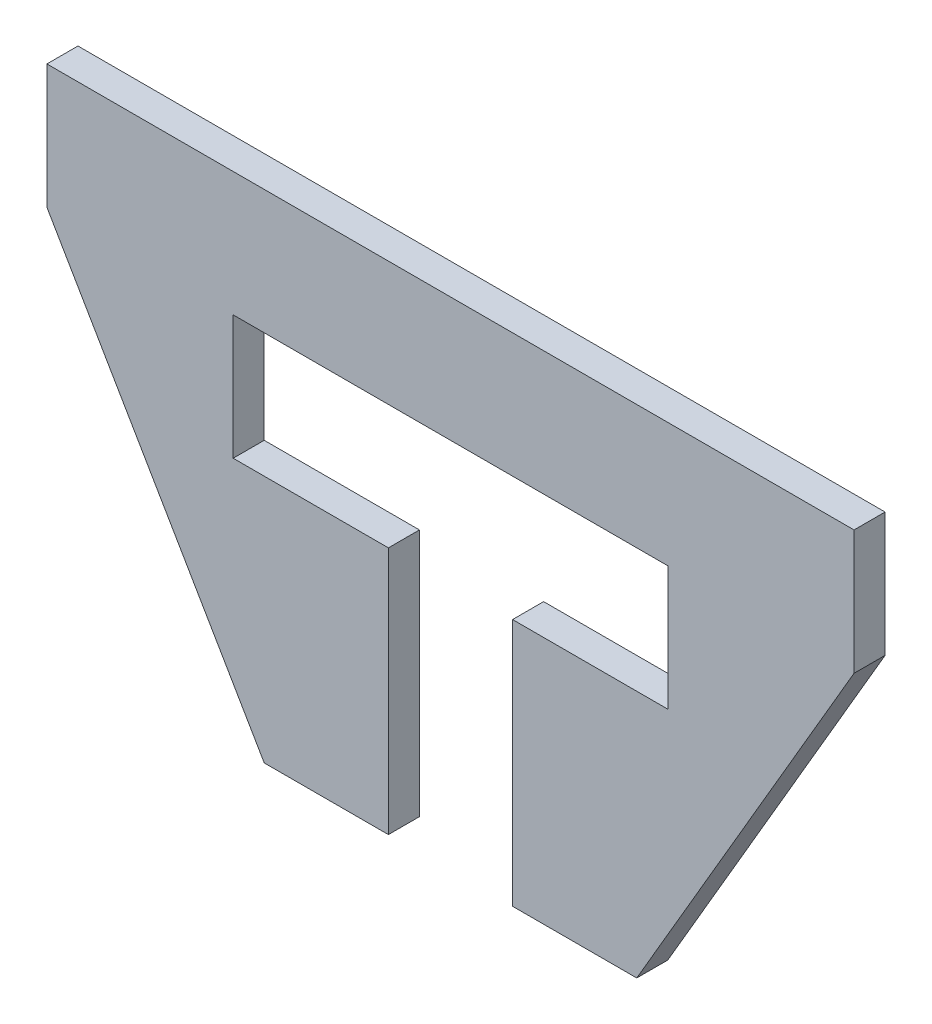
ISO-10303-21;
HEADER;
FILE_DESCRIPTION(('STEP AP214'),'2;1');
FILE_NAME('part.step','',(''),(''),'','','');
FILE_SCHEMA(('AUTOMOTIVE_DESIGN { 1 0 10303 214 1 1 1 1 }'));
ENDSEC;
DATA;
#1=APPLICATION_CONTEXT('core data for automotive mechanical design processes');
#2=APPLICATION_PROTOCOL_DEFINITION('international standard','automotive_design',2000,#1);
#3=PRODUCT_CONTEXT('',#1,'mechanical');
#4=PRODUCT('Part','Part','',(#3));
#5=PRODUCT_RELATED_PRODUCT_CATEGORY('part','',(#4));
#6=PRODUCT_DEFINITION_FORMATION('','',#4);
#7=PRODUCT_DEFINITION_CONTEXT('part definition',#1,'design');
#8=PRODUCT_DEFINITION('design','',#6,#7);
#9=PRODUCT_DEFINITION_SHAPE('','',#8);
#10=(LENGTH_UNIT() NAMED_UNIT(*) SI_UNIT(.MILLI.,.METRE.));
#11=(NAMED_UNIT(*) PLANE_ANGLE_UNIT() SI_UNIT($,.RADIAN.));
#12=(NAMED_UNIT(*) SI_UNIT($,.STERADIAN.) SOLID_ANGLE_UNIT());
#13=UNCERTAINTY_MEASURE_WITH_UNIT(LENGTH_MEASURE(1.E-05),#10,'distance_accuracy_value','');
#14=(GEOMETRIC_REPRESENTATION_CONTEXT(3) GLOBAL_UNCERTAINTY_ASSIGNED_CONTEXT((#13)) GLOBAL_UNIT_ASSIGNED_CONTEXT((#10,
#11,#12)) REPRESENTATION_CONTEXT('',''));
#15=CARTESIAN_POINT('',(0.,0.,0.));
#16=DIRECTION('',(0.,0.,1.));
#17=DIRECTION('',(1.,0.,0.));
#18=AXIS2_PLACEMENT_3D('',#15,#16,#17);
#19=CARTESIAN_POINT('',(0.,-25.4,6.35));
#20=DIRECTION('',(-1.,0.,0.));
#21=DIRECTION('',(0.,0.,1.));
#22=AXIS2_PLACEMENT_3D('',#19,#20,#21);
#23=PLANE('',#22);
#24=DIRECTION('',(0.,1.,0.));
#25=VECTOR('',#24,1.);
#26=CARTESIAN_POINT('',(0.,-25.4,0.));
#27=LINE('',#26,#25);
#28=CARTESIAN_POINT('',(0.,-25.4,0.));
#29=VERTEX_POINT('',#28);
#30=CARTESIAN_POINT('',(0.,0.,0.));
#31=VERTEX_POINT('',#30);
#32=EDGE_CURVE('E166',#29,#31,#27,.T.);
#33=ORIENTED_EDGE('',*,*,#32,.F.);
#34=DIRECTION('',(0.,0.,-1.));
#35=VECTOR('',#34,1.);
#36=CARTESIAN_POINT('',(0.,-25.4,6.35));
#37=LINE('',#36,#35);
#38=CARTESIAN_POINT('',(0.,-25.4,6.35));
#39=VERTEX_POINT('',#38);
#40=EDGE_CURVE('E11',#39,#29,#37,.T.);
#41=ORIENTED_EDGE('',*,*,#40,.F.);
#42=DIRECTION('',(0.,1.,0.));
#43=VECTOR('',#42,1.);
#44=CARTESIAN_POINT('',(0.,-25.4,6.35));
#45=LINE('',#44,#43);
#46=CARTESIAN_POINT('',(0.,0.,6.35));
#47=VERTEX_POINT('',#46);
#48=EDGE_CURVE('E204',#39,#47,#45,.T.);
#49=ORIENTED_EDGE('',*,*,#48,.T.);
#50=DIRECTION('',(0.,0.,-1.));
#51=VECTOR('',#50,1.);
#52=CARTESIAN_POINT('',(0.,0.,6.35));
#53=LINE('',#52,#51);
#54=EDGE_CURVE('E36',#47,#31,#53,.T.);
#55=ORIENTED_EDGE('',*,*,#54,.T.);
#56=EDGE_LOOP('',(#33,#41,#49,#55));
#57=FACE_BOUND('',#56,.T.);
#58=ADVANCED_FACE('F33',(#57),#23,.T.);
#59=CARTESIAN_POINT('',(44.45,-101.6,6.35));
#60=DIRECTION('',(-0.863778900898433,-0.503871025524086,0.));
#61=DIRECTION('',(0.503871025524086,-0.863778900898433,0.));
#62=AXIS2_PLACEMENT_3D('',#59,#60,#61);
#63=PLANE('',#62);
#64=DIRECTION('',(-0.503871025524086,0.863778900898433,0.));
#65=VECTOR('',#64,1.);
#66=CARTESIAN_POINT('',(44.45,-101.6,0.));
#67=LINE('',#66,#65);
#68=CARTESIAN_POINT('',(44.45,-101.6,0.));
#69=VERTEX_POINT('',#68);
#70=EDGE_CURVE('E202',#69,#29,#67,.T.);
#71=ORIENTED_EDGE('',*,*,#70,.F.);
#72=DIRECTION('',(0.,0.,-1.));
#73=VECTOR('',#72,1.);
#74=CARTESIAN_POINT('',(44.45,-101.6,6.35));
#75=LINE('',#74,#73);
#76=CARTESIAN_POINT('',(44.45,-101.6,6.35));
#77=VERTEX_POINT('',#76);
#78=EDGE_CURVE('E42',#77,#69,#75,.T.);
#79=ORIENTED_EDGE('',*,*,#78,.F.);
#80=DIRECTION('',(-0.503871025524086,0.863778900898433,0.));
#81=VECTOR('',#80,1.);
#82=CARTESIAN_POINT('',(44.45,-101.6,6.35));
#83=LINE('',#82,#81);
#84=EDGE_CURVE('E156',#77,#39,#83,.T.);
#85=ORIENTED_EDGE('',*,*,#84,.T.);
#86=ORIENTED_EDGE('',*,*,#40,.T.);
#87=EDGE_LOOP('',(#71,#79,#85,#86));
#88=FACE_BOUND('',#87,.T.);
#89=ADVANCED_FACE('F228',(#88),#63,.T.);
#90=CARTESIAN_POINT('',(69.85,-101.6,6.35));
#91=DIRECTION('',(0.,-1.,0.));
#92=DIRECTION('',(0.,0.,-1.));
#93=AXIS2_PLACEMENT_3D('',#90,#91,#92);
#94=PLANE('',#93);
#95=DIRECTION('',(-1.,0.,0.));
#96=VECTOR('',#95,1.);
#97=CARTESIAN_POINT('',(69.85,-101.6,0.));
#98=LINE('',#97,#96);
#99=CARTESIAN_POINT('',(69.85,-101.6,0.));
#100=VERTEX_POINT('',#99);
#101=EDGE_CURVE('E143',#100,#69,#98,.T.);
#102=ORIENTED_EDGE('',*,*,#101,.F.);
#103=DIRECTION('',(0.,0.,-1.));
#104=VECTOR('',#103,1.);
#105=CARTESIAN_POINT('',(69.85,-101.6,6.35));
#106=LINE('',#105,#104);
#107=CARTESIAN_POINT('',(69.85,-101.6,6.35));
#108=VERTEX_POINT('',#107);
#109=EDGE_CURVE('E138',#108,#100,#106,.T.);
#110=ORIENTED_EDGE('',*,*,#109,.F.);
#111=DIRECTION('',(-1.,0.,0.));
#112=VECTOR('',#111,1.);
#113=CARTESIAN_POINT('',(69.85,-101.6,6.35));
#114=LINE('',#113,#112);
#115=EDGE_CURVE('E141',#108,#77,#114,.T.);
#116=ORIENTED_EDGE('',*,*,#115,.T.);
#117=ORIENTED_EDGE('',*,*,#78,.T.);
#118=EDGE_LOOP('',(#102,#110,#116,#117));
#119=FACE_BOUND('',#118,.T.);
#120=ADVANCED_FACE('F140',(#119),#94,.T.);
#121=CARTESIAN_POINT('',(69.85,-50.8,6.35));
#122=DIRECTION('',(1.,0.,0.));
#123=DIRECTION('',(0.,0.,-1.));
#124=AXIS2_PLACEMENT_3D('',#121,#122,#123);
#125=PLANE('',#124);
#126=DIRECTION('',(0.,-1.,0.));
#127=VECTOR('',#126,1.);
#128=CARTESIAN_POINT('',(69.85,-50.8,0.));
#129=LINE('',#128,#127);
#130=CARTESIAN_POINT('',(69.85,-50.8,0.));
#131=VERTEX_POINT('',#130);
#132=EDGE_CURVE('E199',#131,#100,#129,.T.);
#133=ORIENTED_EDGE('',*,*,#132,.F.);
#134=DIRECTION('',(0.,0.,-1.));
#135=VECTOR('',#134,1.);
#136=CARTESIAN_POINT('',(69.85,-50.8,6.35));
#137=LINE('',#136,#135);
#138=CARTESIAN_POINT('',(69.85,-50.8,6.35));
#139=VERTEX_POINT('',#138);
#140=EDGE_CURVE('E148',#139,#131,#137,.T.);
#141=ORIENTED_EDGE('',*,*,#140,.F.);
#142=DIRECTION('',(0.,-1.,0.));
#143=VECTOR('',#142,1.);
#144=CARTESIAN_POINT('',(69.85,-50.8,6.35));
#145=LINE('',#144,#143);
#146=EDGE_CURVE('E154',#139,#108,#145,.T.);
#147=ORIENTED_EDGE('',*,*,#146,.T.);
#148=ORIENTED_EDGE('',*,*,#109,.T.);
#149=EDGE_LOOP('',(#133,#141,#147,#148));
#150=FACE_BOUND('',#149,.T.);
#151=ADVANCED_FACE('F158',(#150),#125,.T.);
#152=CARTESIAN_POINT('',(38.1,-50.8,6.35));
#153=DIRECTION('',(0.,1.,0.));
#154=DIRECTION('',(0.,0.,1.));
#155=AXIS2_PLACEMENT_3D('',#152,#153,#154);
#156=PLANE('',#155);
#157=DIRECTION('',(1.,0.,0.));
#158=VECTOR('',#157,1.);
#159=CARTESIAN_POINT('',(38.1,-50.8,0.));
#160=LINE('',#159,#158);
#161=CARTESIAN_POINT('',(38.1,-50.8,0.));
#162=VERTEX_POINT('',#161);
#163=EDGE_CURVE('E196',#162,#131,#160,.T.);
#164=ORIENTED_EDGE('',*,*,#163,.F.);
#165=DIRECTION('',(0.,0.,-1.));
#166=VECTOR('',#165,1.);
#167=CARTESIAN_POINT('',(38.1,-50.8,6.35));
#168=LINE('',#167,#166);
#169=CARTESIAN_POINT('',(38.1,-50.8,6.35));
#170=VERTEX_POINT('',#169);
#171=EDGE_CURVE('E208',#170,#162,#168,.T.);
#172=ORIENTED_EDGE('',*,*,#171,.F.);
#173=DIRECTION('',(1.,0.,0.));
#174=VECTOR('',#173,1.);
#175=CARTESIAN_POINT('',(38.1,-50.8,6.35));
#176=LINE('',#175,#174);
#177=EDGE_CURVE('E159',#170,#139,#176,.T.);
#178=ORIENTED_EDGE('',*,*,#177,.T.);
#179=ORIENTED_EDGE('',*,*,#140,.T.);
#180=EDGE_LOOP('',(#164,#172,#178,#179));
#181=FACE_BOUND('',#180,.T.);
#182=ADVANCED_FACE('F241',(#181),#156,.T.);
#183=CARTESIAN_POINT('',(38.1,-25.4,6.35));
#184=DIRECTION('',(1.,0.,0.));
#185=DIRECTION('',(0.,0.,-1.));
#186=AXIS2_PLACEMENT_3D('',#183,#184,#185);
#187=PLANE('',#186);
#188=DIRECTION('',(0.,-1.,0.));
#189=VECTOR('',#188,1.);
#190=CARTESIAN_POINT('',(38.1,-25.4,0.));
#191=LINE('',#190,#189);
#192=CARTESIAN_POINT('',(38.1,-25.4,0.));
#193=VERTEX_POINT('',#192);
#194=EDGE_CURVE('E193',#193,#162,#191,.T.);
#195=ORIENTED_EDGE('',*,*,#194,.F.);
#196=DIRECTION('',(0.,0.,-1.));
#197=VECTOR('',#196,1.);
#198=CARTESIAN_POINT('',(38.1,-25.4,6.35));
#199=LINE('',#198,#197);
#200=CARTESIAN_POINT('',(38.1,-25.4,6.35));
#201=VERTEX_POINT('',#200);
#202=EDGE_CURVE('E210',#201,#193,#199,.T.);
#203=ORIENTED_EDGE('',*,*,#202,.F.);
#204=DIRECTION('',(0.,-1.,0.));
#205=VECTOR('',#204,1.);
#206=CARTESIAN_POINT('',(38.1,-25.4,6.35));
#207=LINE('',#206,#205);
#208=EDGE_CURVE('E161',#201,#170,#207,.T.);
#209=ORIENTED_EDGE('',*,*,#208,.T.);
#210=ORIENTED_EDGE('',*,*,#171,.T.);
#211=EDGE_LOOP('',(#195,#203,#209,#210));
#212=FACE_BOUND('',#211,.T.);
#213=ADVANCED_FACE('F244',(#212),#187,.T.);
#214=CARTESIAN_POINT('',(127.,-25.4,6.35));
#215=DIRECTION('',(0.,-1.,0.));
#216=DIRECTION('',(0.,0.,-1.));
#217=AXIS2_PLACEMENT_3D('',#214,#215,#216);
#218=PLANE('',#217);
#219=DIRECTION('',(-1.,0.,0.));
#220=VECTOR('',#219,1.);
#221=CARTESIAN_POINT('',(127.,-25.4,0.));
#222=LINE('',#221,#220);
#223=CARTESIAN_POINT('',(127.,-25.4,0.));
#224=VERTEX_POINT('',#223);
#225=EDGE_CURVE('E190',#224,#193,#222,.T.);
#226=ORIENTED_EDGE('',*,*,#225,.F.);
#227=DIRECTION('',(0.,0.,-1.));
#228=VECTOR('',#227,1.);
#229=CARTESIAN_POINT('',(127.,-25.4,6.35));
#230=LINE('',#229,#228);
#231=CARTESIAN_POINT('',(127.,-25.4,6.35));
#232=VERTEX_POINT('',#231);
#233=EDGE_CURVE('E212',#232,#224,#230,.T.);
#234=ORIENTED_EDGE('',*,*,#233,.F.);
#235=DIRECTION('',(-1.,0.,0.));
#236=VECTOR('',#235,1.);
#237=CARTESIAN_POINT('',(127.,-25.4,6.35));
#238=LINE('',#237,#236);
#239=EDGE_CURVE('E401',#232,#201,#238,.T.);
#240=ORIENTED_EDGE('',*,*,#239,.T.);
#241=ORIENTED_EDGE('',*,*,#202,.T.);
#242=EDGE_LOOP('',(#226,#234,#240,#241));
#243=FACE_BOUND('',#242,.T.);
#244=ADVANCED_FACE('F248',(#243),#218,.T.);
#245=CARTESIAN_POINT('',(127.,-50.8,6.35));
#246=DIRECTION('',(-1.,0.,0.));
#247=DIRECTION('',(0.,0.,1.));
#248=AXIS2_PLACEMENT_3D('',#245,#246,#247);
#249=PLANE('',#248);
#250=DIRECTION('',(0.,1.,0.));
#251=VECTOR('',#250,1.);
#252=CARTESIAN_POINT('',(127.,-50.8,0.));
#253=LINE('',#252,#251);
#254=CARTESIAN_POINT('',(127.,-50.8,0.));
#255=VERTEX_POINT('',#254);
#256=EDGE_CURVE('E187',#255,#224,#253,.T.);
#257=ORIENTED_EDGE('',*,*,#256,.F.);
#258=DIRECTION('',(0.,0.,-1.));
#259=VECTOR('',#258,1.);
#260=CARTESIAN_POINT('',(127.,-50.8,6.35));
#261=LINE('',#260,#259);
#262=CARTESIAN_POINT('',(127.,-50.8,6.35));
#263=VERTEX_POINT('',#262);
#264=EDGE_CURVE('E214',#263,#255,#261,.T.);
#265=ORIENTED_EDGE('',*,*,#264,.F.);
#266=DIRECTION('',(0.,1.,0.));
#267=VECTOR('',#266,1.);
#268=CARTESIAN_POINT('',(127.,-50.8,6.35));
#269=LINE('',#268,#267);
#270=EDGE_CURVE('E394',#263,#232,#269,.T.);
#271=ORIENTED_EDGE('',*,*,#270,.T.);
#272=ORIENTED_EDGE('',*,*,#233,.T.);
#273=EDGE_LOOP('',(#257,#265,#271,#272));
#274=FACE_BOUND('',#273,.T.);
#275=ADVANCED_FACE('F252',(#274),#249,.T.);
#276=CARTESIAN_POINT('',(95.25,-50.8,6.35));
#277=DIRECTION('',(0.,1.,0.));
#278=DIRECTION('',(0.,0.,1.));
#279=AXIS2_PLACEMENT_3D('',#276,#277,#278);
#280=PLANE('',#279);
#281=DIRECTION('',(1.,0.,0.));
#282=VECTOR('',#281,1.);
#283=CARTESIAN_POINT('',(95.25,-50.8,0.));
#284=LINE('',#283,#282);
#285=CARTESIAN_POINT('',(95.25,-50.8,0.));
#286=VERTEX_POINT('',#285);
#287=EDGE_CURVE('E184',#286,#255,#284,.T.);
#288=ORIENTED_EDGE('',*,*,#287,.F.);
#289=DIRECTION('',(0.,0.,-1.));
#290=VECTOR('',#289,1.);
#291=CARTESIAN_POINT('',(95.25,-50.8,6.35));
#292=LINE('',#291,#290);
#293=CARTESIAN_POINT('',(95.25,-50.8,6.35));
#294=VERTEX_POINT('',#293);
#295=EDGE_CURVE('E216',#294,#286,#292,.T.);
#296=ORIENTED_EDGE('',*,*,#295,.F.);
#297=DIRECTION('',(1.,0.,0.));
#298=VECTOR('',#297,1.);
#299=CARTESIAN_POINT('',(95.25,-50.8,6.35));
#300=LINE('',#299,#298);
#301=EDGE_CURVE('E390',#294,#263,#300,.T.);
#302=ORIENTED_EDGE('',*,*,#301,.T.);
#303=ORIENTED_EDGE('',*,*,#264,.T.);
#304=EDGE_LOOP('',(#288,#296,#302,#303));
#305=FACE_BOUND('',#304,.T.);
#306=ADVANCED_FACE('F256',(#305),#280,.T.);
#307=CARTESIAN_POINT('',(95.25,-101.6,6.35));
#308=DIRECTION('',(-1.,0.,0.));
#309=DIRECTION('',(0.,0.,1.));
#310=AXIS2_PLACEMENT_3D('',#307,#308,#309);
#311=PLANE('',#310);
#312=DIRECTION('',(0.,1.,0.));
#313=VECTOR('',#312,1.);
#314=CARTESIAN_POINT('',(95.25,-101.6,0.));
#315=LINE('',#314,#313);
#316=CARTESIAN_POINT('',(95.25,-101.6,0.));
#317=VERTEX_POINT('',#316);
#318=EDGE_CURVE('E181',#317,#286,#315,.T.);
#319=ORIENTED_EDGE('',*,*,#318,.F.);
#320=DIRECTION('',(0.,0.,-1.));
#321=VECTOR('',#320,1.);
#322=CARTESIAN_POINT('',(95.25,-101.6,6.35));
#323=LINE('',#322,#321);
#324=CARTESIAN_POINT('',(95.25,-101.6,6.35));
#325=VERTEX_POINT('',#324);
#326=EDGE_CURVE('E218',#325,#317,#323,.T.);
#327=ORIENTED_EDGE('',*,*,#326,.F.);
#328=DIRECTION('',(0.,1.,0.));
#329=VECTOR('',#328,1.);
#330=CARTESIAN_POINT('',(95.25,-101.6,6.35));
#331=LINE('',#330,#329);
#332=EDGE_CURVE('E406',#325,#294,#331,.T.);
#333=ORIENTED_EDGE('',*,*,#332,.T.);
#334=ORIENTED_EDGE('',*,*,#295,.T.);
#335=EDGE_LOOP('',(#319,#327,#333,#334));
#336=FACE_BOUND('',#335,.T.);
#337=ADVANCED_FACE('F260',(#336),#311,.T.);
#338=CARTESIAN_POINT('',(120.65,-101.6,6.35));
#339=DIRECTION('',(0.,-1.,0.));
#340=DIRECTION('',(1.,0.,0.));
#341=AXIS2_PLACEMENT_3D('',#338,#339,#340);
#342=PLANE('',#341);
#343=DIRECTION('',(-1.,0.,0.));
#344=VECTOR('',#343,1.);
#345=CARTESIAN_POINT('',(120.65,-101.6,0.));
#346=LINE('',#345,#344);
#347=CARTESIAN_POINT('',(120.65,-101.6,0.));
#348=VERTEX_POINT('',#347);
#349=EDGE_CURVE('E178',#348,#317,#346,.T.);
#350=ORIENTED_EDGE('',*,*,#349,.F.);
#351=DIRECTION('',(0.,0.,-1.));
#352=VECTOR('',#351,1.);
#353=CARTESIAN_POINT('',(120.65,-101.6,6.35));
#354=LINE('',#353,#352);
#355=CARTESIAN_POINT('',(120.65,-101.6,6.35));
#356=VERTEX_POINT('',#355);
#357=EDGE_CURVE('E220',#356,#348,#354,.T.);
#358=ORIENTED_EDGE('',*,*,#357,.F.);
#359=DIRECTION('',(-1.,0.,0.));
#360=VECTOR('',#359,1.);
#361=CARTESIAN_POINT('',(120.65,-101.6,6.35));
#362=LINE('',#361,#360);
#363=EDGE_CURVE('E383',#356,#325,#362,.T.);
#364=ORIENTED_EDGE('',*,*,#363,.T.);
#365=ORIENTED_EDGE('',*,*,#326,.T.);
#366=EDGE_LOOP('',(#350,#358,#364,#365));
#367=FACE_BOUND('',#366,.T.);
#368=ADVANCED_FACE('F264',(#367),#342,.T.);
#369=CARTESIAN_POINT('',(165.1,-25.4,6.35));
#370=DIRECTION('',(0.863778900898433,-0.503871025524086,0.));
#371=DIRECTION('',(0.503871025524086,0.863778900898434,0.));
#372=AXIS2_PLACEMENT_3D('',#369,#370,#371);
#373=PLANE('',#372);
#374=DIRECTION('',(-0.503871025524086,-0.863778900898434,0.));
#375=VECTOR('',#374,1.);
#376=CARTESIAN_POINT('',(165.1,-25.4,0.));
#377=LINE('',#376,#375);
#378=CARTESIAN_POINT('',(165.1,-25.4,0.));
#379=VERTEX_POINT('',#378);
#380=EDGE_CURVE('E175',#379,#348,#377,.T.);
#381=ORIENTED_EDGE('',*,*,#380,.F.);
#382=DIRECTION('',(0.,0.,-1.));
#383=VECTOR('',#382,1.);
#384=CARTESIAN_POINT('',(165.1,-25.4,6.35));
#385=LINE('',#384,#383);
#386=CARTESIAN_POINT('',(165.1,-25.4,6.35));
#387=VERTEX_POINT('',#386);
#388=EDGE_CURVE('E222',#387,#379,#385,.T.);
#389=ORIENTED_EDGE('',*,*,#388,.F.);
#390=DIRECTION('',(-0.503871025524086,-0.863778900898434,0.));
#391=VECTOR('',#390,1.);
#392=CARTESIAN_POINT('',(165.1,-25.4,6.35));
#393=LINE('',#392,#391);
#394=EDGE_CURVE('E379',#387,#356,#393,.T.);
#395=ORIENTED_EDGE('',*,*,#394,.T.);
#396=ORIENTED_EDGE('',*,*,#357,.T.);
#397=EDGE_LOOP('',(#381,#389,#395,#396));
#398=FACE_BOUND('',#397,.T.);
#399=ADVANCED_FACE('F268',(#398),#373,.T.);
#400=CARTESIAN_POINT('',(165.1,0.,6.35));
#401=DIRECTION('',(1.,0.,0.));
#402=DIRECTION('',(0.,0.,-1.));
#403=AXIS2_PLACEMENT_3D('',#400,#401,#402);
#404=PLANE('',#403);
#405=DIRECTION('',(0.,-1.,0.));
#406=VECTOR('',#405,1.);
#407=CARTESIAN_POINT('',(165.1,0.,0.));
#408=LINE('',#407,#406);
#409=CARTESIAN_POINT('',(165.1,0.,0.));
#410=VERTEX_POINT('',#409);
#411=EDGE_CURVE('E172',#410,#379,#408,.T.);
#412=ORIENTED_EDGE('',*,*,#411,.F.);
#413=DIRECTION('',(0.,0.,-1.));
#414=VECTOR('',#413,1.);
#415=CARTESIAN_POINT('',(165.1,0.,6.35));
#416=LINE('',#415,#414);
#417=CARTESIAN_POINT('',(165.1,0.,6.35));
#418=VERTEX_POINT('',#417);
#419=EDGE_CURVE('E223',#418,#410,#416,.T.);
#420=ORIENTED_EDGE('',*,*,#419,.F.);
#421=DIRECTION('',(0.,-1.,0.));
#422=VECTOR('',#421,1.);
#423=CARTESIAN_POINT('',(165.1,0.,6.35));
#424=LINE('',#423,#422);
#425=EDGE_CURVE('E410',#418,#387,#424,.T.);
#426=ORIENTED_EDGE('',*,*,#425,.T.);
#427=ORIENTED_EDGE('',*,*,#388,.T.);
#428=EDGE_LOOP('',(#412,#420,#426,#427));
#429=FACE_BOUND('',#428,.T.);
#430=ADVANCED_FACE('F272',(#429),#404,.T.);
#431=CARTESIAN_POINT('',(0.,0.,6.35));
#432=DIRECTION('',(0.,1.,0.));
#433=DIRECTION('',(0.,0.,1.));
#434=AXIS2_PLACEMENT_3D('',#431,#432,#433);
#435=PLANE('',#434);
#436=DIRECTION('',(1.,0.,0.));
#437=VECTOR('',#436,1.);
#438=CARTESIAN_POINT('',(0.,0.,0.));
#439=LINE('',#438,#437);
#440=EDGE_CURVE('E169',#31,#410,#439,.T.);
#441=ORIENTED_EDGE('',*,*,#440,.F.);
#442=ORIENTED_EDGE('',*,*,#54,.F.);
#443=DIRECTION('',(1.,0.,0.));
#444=VECTOR('',#443,1.);
#445=CARTESIAN_POINT('',(0.,0.,6.35));
#446=LINE('',#445,#444);
#447=EDGE_CURVE('E412',#47,#418,#446,.T.);
#448=ORIENTED_EDGE('',*,*,#447,.T.);
#449=ORIENTED_EDGE('',*,*,#419,.T.);
#450=EDGE_LOOP('',(#441,#442,#448,#449));
#451=FACE_BOUND('',#450,.T.);
#452=ADVANCED_FACE('F225',(#451),#435,.T.);
#453=CARTESIAN_POINT('',(0.,0.,6.35));
#454=DIRECTION('',(0.,0.,-1.));
#455=DIRECTION('',(-1.,0.,0.));
#456=AXIS2_PLACEMENT_3D('',#453,#454,#455);
#457=PLANE('',#456);
#458=ORIENTED_EDGE('',*,*,#48,.F.);
#459=ORIENTED_EDGE('',*,*,#84,.F.);
#460=ORIENTED_EDGE('',*,*,#115,.F.);
#461=ORIENTED_EDGE('',*,*,#146,.F.);
#462=ORIENTED_EDGE('',*,*,#177,.F.);
#463=ORIENTED_EDGE('',*,*,#208,.F.);
#464=ORIENTED_EDGE('',*,*,#239,.F.);
#465=ORIENTED_EDGE('',*,*,#270,.F.);
#466=ORIENTED_EDGE('',*,*,#301,.F.);
#467=ORIENTED_EDGE('',*,*,#332,.F.);
#468=ORIENTED_EDGE('',*,*,#363,.F.);
#469=ORIENTED_EDGE('',*,*,#394,.F.);
#470=ORIENTED_EDGE('',*,*,#425,.F.);
#471=ORIENTED_EDGE('',*,*,#447,.F.);
#472=EDGE_LOOP('',(#458,#459,#460,#461,#462,#463,#464,#465,#466,#467,#468,#469,#470,#471));
#473=FACE_BOUND('',#472,.T.);
#474=ADVANCED_FACE('F152',(#473),#457,.F.);
#475=CARTESIAN_POINT('',(0.,0.,0.));
#476=DIRECTION('',(0.,0.,-1.));
#477=DIRECTION('',(-1.,0.,0.));
#478=AXIS2_PLACEMENT_3D('',#475,#476,#477);
#479=PLANE('',#478);
#480=ORIENTED_EDGE('',*,*,#32,.T.);
#481=ORIENTED_EDGE('',*,*,#440,.T.);
#482=ORIENTED_EDGE('',*,*,#411,.T.);
#483=ORIENTED_EDGE('',*,*,#380,.T.);
#484=ORIENTED_EDGE('',*,*,#349,.T.);
#485=ORIENTED_EDGE('',*,*,#318,.T.);
#486=ORIENTED_EDGE('',*,*,#287,.T.);
#487=ORIENTED_EDGE('',*,*,#256,.T.);
#488=ORIENTED_EDGE('',*,*,#225,.T.);
#489=ORIENTED_EDGE('',*,*,#194,.T.);
#490=ORIENTED_EDGE('',*,*,#163,.T.);
#491=ORIENTED_EDGE('',*,*,#132,.T.);
#492=ORIENTED_EDGE('',*,*,#101,.T.);
#493=ORIENTED_EDGE('',*,*,#70,.T.);
#494=EDGE_LOOP('',(#480,#481,#482,#483,#484,#485,#486,#487,#488,#489,#490,#491,#492,#493));
#495=FACE_BOUND('',#494,.T.);
#496=ADVANCED_FACE('F227',(#495),#479,.T.);
#497=CLOSED_SHELL('',(#58,#89,#120,#151,#182,#213,#244,#275,#306,#337,#368,#399,#430,#452,#474,#496));
#498=MANIFOLD_SOLID_BREP('B2',#497);
#499=ADVANCED_BREP_SHAPE_REPRESENTATION('',(#18,#498),#14);
#500=SHAPE_DEFINITION_REPRESENTATION(#9,#499);
ENDSEC;
END-ISO-10303-21;
